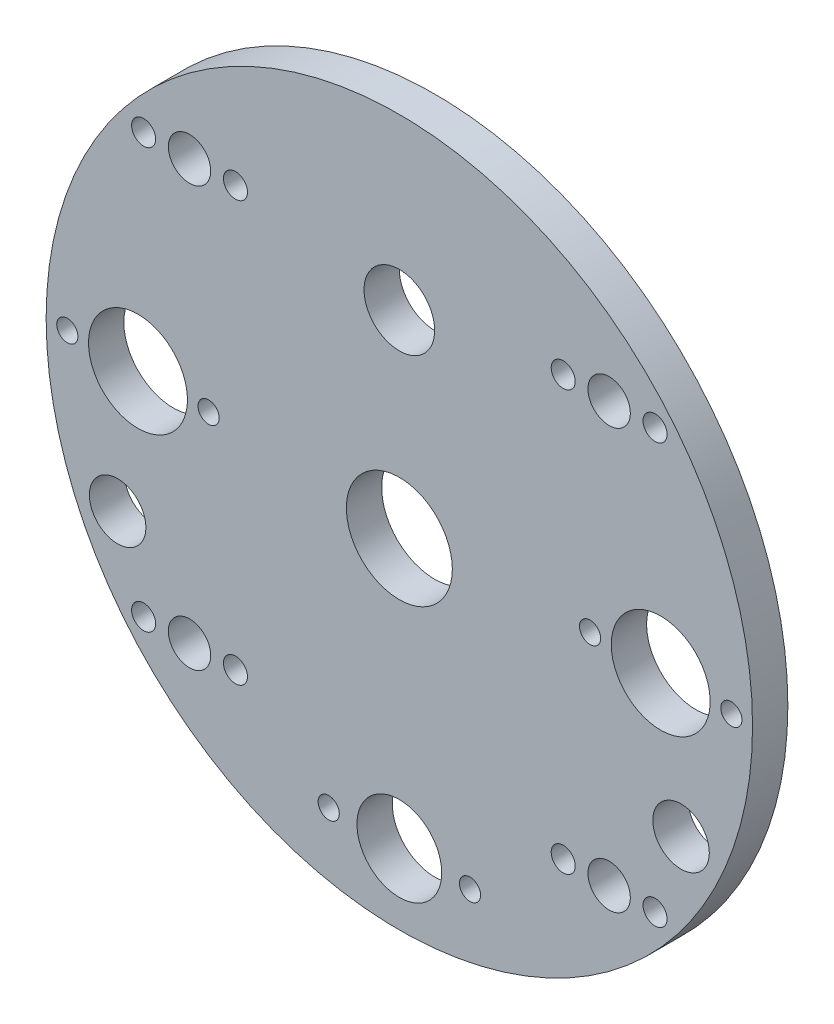
ISO-10303-21;
HEADER;
FILE_DESCRIPTION(('STEP AP214'),'2;1');
FILE_NAME('part.step','',(''),(''),'','','');
FILE_SCHEMA(('AUTOMOTIVE_DESIGN { 1 0 10303 214 1 1 1 1 }'));
ENDSEC;
DATA;
#1=APPLICATION_CONTEXT('core data for automotive mechanical design processes');
#2=APPLICATION_PROTOCOL_DEFINITION('international standard','automotive_design',2000,#1);
#3=PRODUCT_CONTEXT('',#1,'mechanical');
#4=PRODUCT('Part','Part','',(#3));
#5=PRODUCT_RELATED_PRODUCT_CATEGORY('part','',(#4));
#6=PRODUCT_DEFINITION_FORMATION('','',#4);
#7=PRODUCT_DEFINITION_CONTEXT('part definition',#1,'design');
#8=PRODUCT_DEFINITION('design','',#6,#7);
#9=PRODUCT_DEFINITION_SHAPE('','',#8);
#10=(LENGTH_UNIT() NAMED_UNIT(*) SI_UNIT(.MILLI.,.METRE.));
#11=(NAMED_UNIT(*) PLANE_ANGLE_UNIT() SI_UNIT($,.RADIAN.));
#12=(NAMED_UNIT(*) SI_UNIT($,.STERADIAN.) SOLID_ANGLE_UNIT());
#13=UNCERTAINTY_MEASURE_WITH_UNIT(LENGTH_MEASURE(1.E-05),#10,'distance_accuracy_value','');
#14=(GEOMETRIC_REPRESENTATION_CONTEXT(3) GLOBAL_UNCERTAINTY_ASSIGNED_CONTEXT((#13)) GLOBAL_UNIT_ASSIGNED_CONTEXT((#10,
#11,#12)) REPRESENTATION_CONTEXT('',''));
#15=CARTESIAN_POINT('',(0.,0.,0.));
#16=DIRECTION('',(0.,0.,1.));
#17=DIRECTION('',(1.,0.,0.));
#18=AXIS2_PLACEMENT_3D('',#15,#16,#17);
#19=CARTESIAN_POINT('',(0.,0.,5.));
#20=DIRECTION('',(0.,0.,-1.));
#21=DIRECTION('',(-1.,0.,0.));
#22=AXIS2_PLACEMENT_3D('',#19,#20,#21);
#23=CYLINDRICAL_SURFACE('',#22,50.);
#24=CARTESIAN_POINT('',(0.,0.,5.));
#25=DIRECTION('',(0.,0.,1.));
#26=DIRECTION('',(1.,0.,0.));
#27=AXIS2_PLACEMENT_3D('',#24,#25,#26);
#28=CIRCLE('',#27,50.);
#29=CARTESIAN_POINT('',(50.,0.,5.));
#30=VERTEX_POINT('',#29);
#31=EDGE_CURVE('E10',#30,#30,#28,.T.);
#32=ORIENTED_EDGE('',*,*,#31,.F.);
#33=EDGE_LOOP('',(#32));
#34=FACE_BOUND('',#33,.T.);
#35=CARTESIAN_POINT('',(0.,0.,0.));
#36=DIRECTION('',(0.,0.,1.));
#37=DIRECTION('',(1.,0.,0.));
#38=AXIS2_PLACEMENT_3D('',#35,#36,#37);
#39=CIRCLE('',#38,50.);
#40=CARTESIAN_POINT('',(50.,0.,0.));
#41=VERTEX_POINT('',#40);
#42=EDGE_CURVE('E40',#41,#41,#39,.T.);
#43=ORIENTED_EDGE('',*,*,#42,.T.);
#44=EDGE_LOOP('',(#43));
#45=FACE_BOUND('',#44,.T.);
#46=ADVANCED_FACE('F33',(#34,#45),#23,.T.);
#47=CARTESIAN_POINT('',(0.,0.,5.));
#48=DIRECTION('',(0.,0.,1.));
#49=DIRECTION('',(1.,0.,0.));
#50=AXIS2_PLACEMENT_3D('',#47,#48,#49);
#51=PLANE('',#50);
#52=CARTESIAN_POINT('',(36.1984848098347,-29.6984848098353,5.));
#53=DIRECTION('',(0.,0.,1.));
#54=DIRECTION('',(1.,0.,0.));
#55=AXIS2_PLACEMENT_3D('',#52,#53,#54);
#56=CIRCLE('',#55,1.7);
#57=CARTESIAN_POINT('',(37.8984848098347,-29.6984848098353,5.));
#58=VERTEX_POINT('',#57);
#59=EDGE_CURVE('E183',#58,#58,#56,.T.);
#60=ORIENTED_EDGE('',*,*,#59,.F.);
#61=EDGE_LOOP('',(#60));
#62=FACE_BOUND('',#61,.T.);
#63=CARTESIAN_POINT('',(23.1984848098347,-29.6984848098353,5.));
#64=DIRECTION('',(0.,0.,1.));
#65=DIRECTION('',(1.,0.,0.));
#66=AXIS2_PLACEMENT_3D('',#63,#64,#65);
#67=CIRCLE('',#66,1.7);
#68=CARTESIAN_POINT('',(24.8984848098347,-29.6984848098353,5.));
#69=VERTEX_POINT('',#68);
#70=EDGE_CURVE('E187',#69,#69,#67,.T.);
#71=ORIENTED_EDGE('',*,*,#70,.F.);
#72=EDGE_LOOP('',(#71));
#73=FACE_BOUND('',#72,.T.);
#74=CARTESIAN_POINT('',(36.1984848098347,29.6984848098353,5.));
#75=DIRECTION('',(0.,0.,1.));
#76=DIRECTION('',(1.,0.,0.));
#77=AXIS2_PLACEMENT_3D('',#74,#75,#76);
#78=CIRCLE('',#77,1.7);
#79=CARTESIAN_POINT('',(37.8984848098347,29.6984848098353,5.));
#80=VERTEX_POINT('',#79);
#81=EDGE_CURVE('E191',#80,#80,#78,.T.);
#82=ORIENTED_EDGE('',*,*,#81,.F.);
#83=EDGE_LOOP('',(#82));
#84=FACE_BOUND('',#83,.T.);
#85=CARTESIAN_POINT('',(23.1984848098347,29.6984848098353,5.));
#86=DIRECTION('',(0.,0.,1.));
#87=DIRECTION('',(1.,0.,0.));
#88=AXIS2_PLACEMENT_3D('',#85,#86,#87);
#89=CIRCLE('',#88,1.7);
#90=CARTESIAN_POINT('',(24.8984848098347,29.6984848098353,5.));
#91=VERTEX_POINT('',#90);
#92=EDGE_CURVE('E195',#91,#91,#89,.T.);
#93=ORIENTED_EDGE('',*,*,#92,.F.);
#94=EDGE_LOOP('',(#93));
#95=FACE_BOUND('',#94,.T.);
#96=CARTESIAN_POINT('',(-36.1984848098347,29.6984848098353,5.));
#97=DIRECTION('',(0.,0.,1.));
#98=DIRECTION('',(1.,0.,0.));
#99=AXIS2_PLACEMENT_3D('',#96,#97,#98);
#100=CIRCLE('',#99,1.7);
#101=CARTESIAN_POINT('',(-34.4984848098347,29.6984848098353,5.));
#102=VERTEX_POINT('',#101);
#103=EDGE_CURVE('E199',#102,#102,#100,.T.);
#104=ORIENTED_EDGE('',*,*,#103,.F.);
#105=EDGE_LOOP('',(#104));
#106=FACE_BOUND('',#105,.T.);
#107=CARTESIAN_POINT('',(-23.1984848098347,29.6984848098353,5.));
#108=DIRECTION('',(0.,0.,1.));
#109=DIRECTION('',(1.,0.,0.));
#110=AXIS2_PLACEMENT_3D('',#107,#108,#109);
#111=CIRCLE('',#110,1.7);
#112=CARTESIAN_POINT('',(-21.4984848098347,29.6984848098353,5.));
#113=VERTEX_POINT('',#112);
#114=EDGE_CURVE('E203',#113,#113,#111,.T.);
#115=ORIENTED_EDGE('',*,*,#114,.F.);
#116=EDGE_LOOP('',(#115));
#117=FACE_BOUND('',#116,.T.);
#118=CARTESIAN_POINT('',(-36.1984848098347,-29.6984848098353,5.));
#119=DIRECTION('',(0.,0.,1.));
#120=DIRECTION('',(1.,0.,0.));
#121=AXIS2_PLACEMENT_3D('',#118,#119,#120);
#122=CIRCLE('',#121,1.7);
#123=CARTESIAN_POINT('',(-34.4984848098347,-29.6984848098353,5.));
#124=VERTEX_POINT('',#123);
#125=EDGE_CURVE('E207',#124,#124,#122,.T.);
#126=ORIENTED_EDGE('',*,*,#125,.F.);
#127=EDGE_LOOP('',(#126));
#128=FACE_BOUND('',#127,.T.);
#129=CARTESIAN_POINT('',(-23.1984848098347,-29.6984848098353,5.));
#130=DIRECTION('',(0.,0.,1.));
#131=DIRECTION('',(1.,0.,0.));
#132=AXIS2_PLACEMENT_3D('',#129,#130,#131);
#133=CIRCLE('',#132,1.7);
#134=CARTESIAN_POINT('',(-21.4984848098347,-29.6984848098353,5.));
#135=VERTEX_POINT('',#134);
#136=EDGE_CURVE('E211',#135,#135,#133,.T.);
#137=ORIENTED_EDGE('',*,*,#136,.F.);
#138=EDGE_LOOP('',(#137));
#139=FACE_BOUND('',#138,.T.);
#140=CARTESIAN_POINT('',(39.8775426296126,-18.5952035165908,5.));
#141=DIRECTION('',(0.,0.,-1.));
#142=DIRECTION('',(-1.,0.,0.));
#143=AXIS2_PLACEMENT_3D('',#140,#141,#142);
#144=CIRCLE('',#143,4.00000000000001);
#145=CARTESIAN_POINT('',(35.8775426296126,-18.5952035165908,5.));
#146=VERTEX_POINT('',#145);
#147=EDGE_CURVE('E109',#146,#146,#144,.T.);
#148=ORIENTED_EDGE('',*,*,#147,.T.);
#149=EDGE_LOOP('',(#148));
#150=FACE_BOUND('',#149,.T.);
#151=CARTESIAN_POINT('',(-39.8775426296126,-18.5952035165908,5.));
#152=DIRECTION('',(0.,0.,1.));
#153=DIRECTION('',(1.,0.,0.));
#154=AXIS2_PLACEMENT_3D('',#151,#152,#153);
#155=CIRCLE('',#154,4.00000000000001);
#156=CARTESIAN_POINT('',(-35.8775426296126,-18.5952035165908,5.));
#157=VERTEX_POINT('',#156);
#158=EDGE_CURVE('E98',#157,#157,#155,.T.);
#159=ORIENTED_EDGE('',*,*,#158,.F.);
#160=EDGE_LOOP('',(#159));
#161=FACE_BOUND('',#160,.T.);
#162=CARTESIAN_POINT('',(-47.,0.,5.));
#163=DIRECTION('',(0.,0.,1.));
#164=DIRECTION('',(1.,0.,0.));
#165=AXIS2_PLACEMENT_3D('',#162,#163,#164);
#166=CIRCLE('',#165,1.5);
#167=CARTESIAN_POINT('',(-45.5,0.,5.));
#168=VERTEX_POINT('',#167);
#169=EDGE_CURVE('E78',#168,#168,#166,.T.);
#170=ORIENTED_EDGE('',*,*,#169,.F.);
#171=EDGE_LOOP('',(#170));
#172=FACE_BOUND('',#171,.T.);
#173=CARTESIAN_POINT('',(0.,-40.,5.));
#174=DIRECTION('',(0.,0.,1.));
#175=DIRECTION('',(1.,0.,0.));
#176=AXIS2_PLACEMENT_3D('',#173,#174,#175);
#177=CIRCLE('',#176,6.);
#178=CARTESIAN_POINT('',(6.,-40.,5.));
#179=VERTEX_POINT('',#178);
#180=EDGE_CURVE('E97',#179,#179,#177,.T.);
#181=ORIENTED_EDGE('',*,*,#180,.F.);
#182=EDGE_LOOP('',(#181));
#183=FACE_BOUND('',#182,.T.);
#184=CARTESIAN_POINT('',(-10.,-40.,5.));
#185=DIRECTION('',(0.,0.,1.));
#186=DIRECTION('',(1.,0.,0.));
#187=AXIS2_PLACEMENT_3D('',#184,#185,#186);
#188=CIRCLE('',#187,1.5);
#189=CARTESIAN_POINT('',(-8.5,-40.,5.));
#190=VERTEX_POINT('',#189);
#191=EDGE_CURVE('E102',#190,#190,#188,.T.);
#192=ORIENTED_EDGE('',*,*,#191,.F.);
#193=EDGE_LOOP('',(#192));
#194=FACE_BOUND('',#193,.T.);
#195=CARTESIAN_POINT('',(-27.,0.,5.));
#196=DIRECTION('',(0.,0.,1.));
#197=DIRECTION('',(1.,0.,0.));
#198=AXIS2_PLACEMENT_3D('',#195,#196,#197);
#199=CIRCLE('',#198,1.5);
#200=CARTESIAN_POINT('',(-25.5,0.,5.));
#201=VERTEX_POINT('',#200);
#202=EDGE_CURVE('E115',#201,#201,#199,.T.);
#203=ORIENTED_EDGE('',*,*,#202,.F.);
#204=EDGE_LOOP('',(#203));
#205=FACE_BOUND('',#204,.T.);
#206=CARTESIAN_POINT('',(27.,0.,5.));
#207=DIRECTION('',(0.,0.,1.));
#208=DIRECTION('',(1.,0.,0.));
#209=AXIS2_PLACEMENT_3D('',#206,#207,#208);
#210=CIRCLE('',#209,1.5);
#211=CARTESIAN_POINT('',(28.5,0.,5.));
#212=VERTEX_POINT('',#211);
#213=EDGE_CURVE('E122',#212,#212,#210,.T.);
#214=ORIENTED_EDGE('',*,*,#213,.F.);
#215=EDGE_LOOP('',(#214));
#216=FACE_BOUND('',#215,.T.);
#217=CARTESIAN_POINT('',(47.,0.,5.));
#218=DIRECTION('',(0.,0.,1.));
#219=DIRECTION('',(1.,0.,0.));
#220=AXIS2_PLACEMENT_3D('',#217,#218,#219);
#221=CIRCLE('',#220,1.5);
#222=CARTESIAN_POINT('',(48.5,0.,5.));
#223=VERTEX_POINT('',#222);
#224=EDGE_CURVE('E119',#223,#223,#221,.T.);
#225=ORIENTED_EDGE('',*,*,#224,.F.);
#226=EDGE_LOOP('',(#225));
#227=FACE_BOUND('',#226,.T.);
#228=CARTESIAN_POINT('',(10.,-40.,5.));
#229=DIRECTION('',(0.,0.,1.));
#230=DIRECTION('',(1.,0.,0.));
#231=AXIS2_PLACEMENT_3D('',#228,#229,#230);
#232=CIRCLE('',#231,1.5);
#233=CARTESIAN_POINT('',(11.5,-40.,5.));
#234=VERTEX_POINT('',#233);
#235=EDGE_CURVE('E117',#234,#234,#232,.T.);
#236=ORIENTED_EDGE('',*,*,#235,.F.);
#237=EDGE_LOOP('',(#236));
#238=FACE_BOUND('',#237,.T.);
#239=CARTESIAN_POINT('',(0.,-2.,5.));
#240=DIRECTION('',(0.,0.,1.));
#241=DIRECTION('',(1.,0.,0.));
#242=AXIS2_PLACEMENT_3D('',#239,#240,#241);
#243=CIRCLE('',#242,7.5);
#244=CARTESIAN_POINT('',(7.5,-2.,5.));
#245=VERTEX_POINT('',#244);
#246=EDGE_CURVE('E73',#245,#245,#243,.T.);
#247=ORIENTED_EDGE('',*,*,#246,.F.);
#248=EDGE_LOOP('',(#247));
#249=FACE_BOUND('',#248,.T.);
#250=CARTESIAN_POINT('',(-29.6984848098347,-29.6984848098353,5.));
#251=DIRECTION('',(0.,0.,1.));
#252=DIRECTION('',(0.,1.,0.));
#253=AXIS2_PLACEMENT_3D('',#250,#251,#252);
#254=CIRCLE('',#253,3.);
#255=CARTESIAN_POINT('',(-29.6984848098347,-26.6984848098353,5.));
#256=VERTEX_POINT('',#255);
#257=EDGE_CURVE('E63',#256,#256,#254,.T.);
#258=ORIENTED_EDGE('',*,*,#257,.F.);
#259=EDGE_LOOP('',(#258));
#260=FACE_BOUND('',#259,.T.);
#261=CARTESIAN_POINT('',(29.6984848098352,-29.6984848098348,5.));
#262=DIRECTION('',(0.,0.,1.));
#263=DIRECTION('',(-1.,0.,0.));
#264=AXIS2_PLACEMENT_3D('',#261,#262,#263);
#265=CIRCLE('',#264,3.);
#266=CARTESIAN_POINT('',(26.6984848098352,-29.6984848098348,5.));
#267=VERTEX_POINT('',#266);
#268=EDGE_CURVE('E133',#267,#267,#265,.T.);
#269=ORIENTED_EDGE('',*,*,#268,.F.);
#270=EDGE_LOOP('',(#269));
#271=FACE_BOUND('',#270,.T.);
#272=CARTESIAN_POINT('',(29.6984848098345,29.6984848098355,5.));
#273=DIRECTION('',(0.,0.,1.));
#274=DIRECTION('',(0.,-1.,0.));
#275=AXIS2_PLACEMENT_3D('',#272,#273,#274);
#276=CIRCLE('',#275,3.);
#277=CARTESIAN_POINT('',(29.6984848098346,26.6984848098355,5.));
#278=VERTEX_POINT('',#277);
#279=EDGE_CURVE('E72',#278,#278,#276,.T.);
#280=ORIENTED_EDGE('',*,*,#279,.F.);
#281=EDGE_LOOP('',(#280));
#282=FACE_BOUND('',#281,.T.);
#283=CARTESIAN_POINT('',(-29.6984848098352,29.6984848098348,5.));
#284=DIRECTION('',(0.,0.,1.));
#285=DIRECTION('',(1.,0.,0.));
#286=AXIS2_PLACEMENT_3D('',#283,#284,#285);
#287=CIRCLE('',#286,3.);
#288=CARTESIAN_POINT('',(-26.6984848098352,29.6984848098348,5.));
#289=VERTEX_POINT('',#288);
#290=EDGE_CURVE('E58',#289,#289,#287,.T.);
#291=ORIENTED_EDGE('',*,*,#290,.F.);
#292=EDGE_LOOP('',(#291));
#293=FACE_BOUND('',#292,.T.);
#294=CARTESIAN_POINT('',(0.,26.,5.));
#295=DIRECTION('',(0.,0.,1.));
#296=DIRECTION('',(1.,0.,0.));
#297=AXIS2_PLACEMENT_3D('',#294,#295,#296);
#298=CIRCLE('',#297,5.);
#299=CARTESIAN_POINT('',(5.,26.,5.));
#300=VERTEX_POINT('',#299);
#301=EDGE_CURVE('E54',#300,#300,#298,.T.);
#302=ORIENTED_EDGE('',*,*,#301,.F.);
#303=EDGE_LOOP('',(#302));
#304=FACE_BOUND('',#303,.T.);
#305=CARTESIAN_POINT('',(-37.,0.,5.));
#306=DIRECTION('',(0.,0.,-1.));
#307=DIRECTION('',(-1.,0.,0.));
#308=AXIS2_PLACEMENT_3D('',#305,#306,#307);
#309=CIRCLE('',#308,7.);
#310=CARTESIAN_POINT('',(-44.,0.,5.));
#311=VERTEX_POINT('',#310);
#312=EDGE_CURVE('E144',#311,#311,#309,.T.);
#313=ORIENTED_EDGE('',*,*,#312,.T.);
#314=EDGE_LOOP('',(#313));
#315=FACE_BOUND('',#314,.T.);
#316=CARTESIAN_POINT('',(37.,2.68166793467571E-13,5.));
#317=DIRECTION('',(0.,0.,-1.));
#318=DIRECTION('',(-1.,0.,0.));
#319=AXIS2_PLACEMENT_3D('',#316,#317,#318);
#320=CIRCLE('',#319,7.);
#321=CARTESIAN_POINT('',(30.,2.68166793467571E-13,5.));
#322=VERTEX_POINT('',#321);
#323=EDGE_CURVE('E45',#322,#322,#320,.T.);
#324=ORIENTED_EDGE('',*,*,#323,.T.);
#325=EDGE_LOOP('',(#324));
#326=FACE_BOUND('',#325,.T.);
#327=ORIENTED_EDGE('',*,*,#31,.T.);
#328=EDGE_LOOP('',(#327));
#329=FACE_BOUND('',#328,.T.);
#330=ADVANCED_FACE('F153',(#62,#73,#84,#95,#106,#117,#128,#139,#150,#161,#172,#183,#194,#205,
#216,#227,#238,#249,#260,#271,#282,#293,#304,#315,#326,#329),#51,.T.);
#331=CARTESIAN_POINT('',(0.,0.,0.));
#332=DIRECTION('',(0.,0.,1.));
#333=DIRECTION('',(1.,0.,0.));
#334=AXIS2_PLACEMENT_3D('',#331,#332,#333);
#335=PLANE('',#334);
#336=CARTESIAN_POINT('',(36.1984848098347,-29.6984848098353,0.));
#337=DIRECTION('',(0.,0.,1.));
#338=DIRECTION('',(1.,0.,0.));
#339=AXIS2_PLACEMENT_3D('',#336,#337,#338);
#340=CIRCLE('',#339,1.7);
#341=CARTESIAN_POINT('',(37.8984848098347,-29.6984848098353,0.));
#342=VERTEX_POINT('',#341);
#343=EDGE_CURVE('E347',#342,#342,#340,.T.);
#344=ORIENTED_EDGE('',*,*,#343,.T.);
#345=EDGE_LOOP('',(#344));
#346=FACE_BOUND('',#345,.T.);
#347=CARTESIAN_POINT('',(23.1984848098347,-29.6984848098353,0.));
#348=DIRECTION('',(0.,0.,1.));
#349=DIRECTION('',(1.,0.,0.));
#350=AXIS2_PLACEMENT_3D('',#347,#348,#349);
#351=CIRCLE('',#350,1.7);
#352=CARTESIAN_POINT('',(24.8984848098347,-29.6984848098353,0.));
#353=VERTEX_POINT('',#352);
#354=EDGE_CURVE('E352',#353,#353,#351,.T.);
#355=ORIENTED_EDGE('',*,*,#354,.T.);
#356=EDGE_LOOP('',(#355));
#357=FACE_BOUND('',#356,.T.);
#358=CARTESIAN_POINT('',(36.1984848098347,29.6984848098353,0.));
#359=DIRECTION('',(0.,0.,1.));
#360=DIRECTION('',(1.,0.,0.));
#361=AXIS2_PLACEMENT_3D('',#358,#359,#360);
#362=CIRCLE('',#361,1.7);
#363=CARTESIAN_POINT('',(37.8984848098347,29.6984848098353,0.));
#364=VERTEX_POINT('',#363);
#365=EDGE_CURVE('E356',#364,#364,#362,.T.);
#366=ORIENTED_EDGE('',*,*,#365,.T.);
#367=EDGE_LOOP('',(#366));
#368=FACE_BOUND('',#367,.T.);
#369=CARTESIAN_POINT('',(23.1984848098347,29.6984848098353,0.));
#370=DIRECTION('',(0.,0.,1.));
#371=DIRECTION('',(1.,0.,0.));
#372=AXIS2_PLACEMENT_3D('',#369,#370,#371);
#373=CIRCLE('',#372,1.7);
#374=CARTESIAN_POINT('',(24.8984848098347,29.6984848098353,0.));
#375=VERTEX_POINT('',#374);
#376=EDGE_CURVE('E360',#375,#375,#373,.T.);
#377=ORIENTED_EDGE('',*,*,#376,.T.);
#378=EDGE_LOOP('',(#377));
#379=FACE_BOUND('',#378,.T.);
#380=CARTESIAN_POINT('',(-36.1984848098347,29.6984848098353,0.));
#381=DIRECTION('',(0.,0.,1.));
#382=DIRECTION('',(1.,0.,0.));
#383=AXIS2_PLACEMENT_3D('',#380,#381,#382);
#384=CIRCLE('',#383,1.7);
#385=CARTESIAN_POINT('',(-34.4984848098347,29.6984848098353,0.));
#386=VERTEX_POINT('',#385);
#387=EDGE_CURVE('E364',#386,#386,#384,.T.);
#388=ORIENTED_EDGE('',*,*,#387,.T.);
#389=EDGE_LOOP('',(#388));
#390=FACE_BOUND('',#389,.T.);
#391=CARTESIAN_POINT('',(-23.1984848098347,29.6984848098353,0.));
#392=DIRECTION('',(0.,0.,1.));
#393=DIRECTION('',(1.,0.,0.));
#394=AXIS2_PLACEMENT_3D('',#391,#392,#393);
#395=CIRCLE('',#394,1.7);
#396=CARTESIAN_POINT('',(-21.4984848098347,29.6984848098353,0.));
#397=VERTEX_POINT('',#396);
#398=EDGE_CURVE('E368',#397,#397,#395,.T.);
#399=ORIENTED_EDGE('',*,*,#398,.T.);
#400=EDGE_LOOP('',(#399));
#401=FACE_BOUND('',#400,.T.);
#402=CARTESIAN_POINT('',(-36.1984848098347,-29.6984848098353,0.));
#403=DIRECTION('',(0.,0.,1.));
#404=DIRECTION('',(1.,0.,0.));
#405=AXIS2_PLACEMENT_3D('',#402,#403,#404);
#406=CIRCLE('',#405,1.7);
#407=CARTESIAN_POINT('',(-34.4984848098347,-29.6984848098353,0.));
#408=VERTEX_POINT('',#407);
#409=EDGE_CURVE('E372',#408,#408,#406,.T.);
#410=ORIENTED_EDGE('',*,*,#409,.T.);
#411=EDGE_LOOP('',(#410));
#412=FACE_BOUND('',#411,.T.);
#413=CARTESIAN_POINT('',(-23.1984848098347,-29.6984848098353,0.));
#414=DIRECTION('',(0.,0.,1.));
#415=DIRECTION('',(1.,0.,0.));
#416=AXIS2_PLACEMENT_3D('',#413,#414,#415);
#417=CIRCLE('',#416,1.7);
#418=CARTESIAN_POINT('',(-21.4984848098347,-29.6984848098353,0.));
#419=VERTEX_POINT('',#418);
#420=EDGE_CURVE('E375',#419,#419,#417,.T.);
#421=ORIENTED_EDGE('',*,*,#420,.T.);
#422=EDGE_LOOP('',(#421));
#423=FACE_BOUND('',#422,.T.);
#424=CARTESIAN_POINT('',(39.8775426296126,-18.5952035165908,0.));
#425=DIRECTION('',(0.,0.,1.));
#426=DIRECTION('',(1.,0.,0.));
#427=AXIS2_PLACEMENT_3D('',#424,#425,#426);
#428=CIRCLE('',#427,4.00000000000001);
#429=CARTESIAN_POINT('',(43.8775426296126,-18.5952035165908,0.));
#430=VERTEX_POINT('',#429);
#431=EDGE_CURVE('E36',#430,#430,#428,.F.);
#432=ORIENTED_EDGE('',*,*,#431,.F.);
#433=EDGE_LOOP('',(#432));
#434=FACE_BOUND('',#433,.T.);
#435=CARTESIAN_POINT('',(-39.8775426296126,-18.5952035165908,0.));
#436=DIRECTION('',(0.,0.,1.));
#437=DIRECTION('',(1.,0.,0.));
#438=AXIS2_PLACEMENT_3D('',#435,#436,#437);
#439=CIRCLE('',#438,4.00000000000001);
#440=CARTESIAN_POINT('',(-35.8775426296126,-18.5952035165908,0.));
#441=VERTEX_POINT('',#440);
#442=EDGE_CURVE('E95',#441,#441,#439,.T.);
#443=ORIENTED_EDGE('',*,*,#442,.T.);
#444=EDGE_LOOP('',(#443));
#445=FACE_BOUND('',#444,.T.);
#446=CARTESIAN_POINT('',(-47.,0.,0.));
#447=DIRECTION('',(0.,0.,1.));
#448=DIRECTION('',(1.,0.,0.));
#449=AXIS2_PLACEMENT_3D('',#446,#447,#448);
#450=CIRCLE('',#449,1.5);
#451=CARTESIAN_POINT('',(-45.5,0.,0.));
#452=VERTEX_POINT('',#451);
#453=EDGE_CURVE('E93',#452,#452,#450,.T.);
#454=ORIENTED_EDGE('',*,*,#453,.T.);
#455=EDGE_LOOP('',(#454));
#456=FACE_BOUND('',#455,.T.);
#457=CARTESIAN_POINT('',(0.,-40.,0.));
#458=DIRECTION('',(0.,0.,1.));
#459=DIRECTION('',(1.,0.,0.));
#460=AXIS2_PLACEMENT_3D('',#457,#458,#459);
#461=CIRCLE('',#460,6.);
#462=CARTESIAN_POINT('',(6.,-40.,0.));
#463=VERTEX_POINT('',#462);
#464=EDGE_CURVE('E90',#463,#463,#461,.T.);
#465=ORIENTED_EDGE('',*,*,#464,.T.);
#466=EDGE_LOOP('',(#465));
#467=FACE_BOUND('',#466,.T.);
#468=CARTESIAN_POINT('',(-10.,-40.,0.));
#469=DIRECTION('',(0.,0.,1.));
#470=DIRECTION('',(1.,0.,0.));
#471=AXIS2_PLACEMENT_3D('',#468,#469,#470);
#472=CIRCLE('',#471,1.5);
#473=CARTESIAN_POINT('',(-8.5,-40.,0.));
#474=VERTEX_POINT('',#473);
#475=EDGE_CURVE('E87',#474,#474,#472,.T.);
#476=ORIENTED_EDGE('',*,*,#475,.T.);
#477=EDGE_LOOP('',(#476));
#478=FACE_BOUND('',#477,.T.);
#479=CARTESIAN_POINT('',(-27.,0.,0.));
#480=DIRECTION('',(0.,0.,1.));
#481=DIRECTION('',(1.,0.,0.));
#482=AXIS2_PLACEMENT_3D('',#479,#480,#481);
#483=CIRCLE('',#482,1.5);
#484=CARTESIAN_POINT('',(-25.5,0.,0.));
#485=VERTEX_POINT('',#484);
#486=EDGE_CURVE('E84',#485,#485,#483,.T.);
#487=ORIENTED_EDGE('',*,*,#486,.T.);
#488=EDGE_LOOP('',(#487));
#489=FACE_BOUND('',#488,.T.);
#490=CARTESIAN_POINT('',(27.,0.,0.));
#491=DIRECTION('',(0.,0.,1.));
#492=DIRECTION('',(1.,0.,0.));
#493=AXIS2_PLACEMENT_3D('',#490,#491,#492);
#494=CIRCLE('',#493,1.5);
#495=CARTESIAN_POINT('',(28.5,0.,0.));
#496=VERTEX_POINT('',#495);
#497=EDGE_CURVE('E81',#496,#496,#494,.T.);
#498=ORIENTED_EDGE('',*,*,#497,.T.);
#499=EDGE_LOOP('',(#498));
#500=FACE_BOUND('',#499,.T.);
#501=CARTESIAN_POINT('',(47.,0.,0.));
#502=DIRECTION('',(0.,0.,1.));
#503=DIRECTION('',(1.,0.,0.));
#504=AXIS2_PLACEMENT_3D('',#501,#502,#503);
#505=CIRCLE('',#504,1.5);
#506=CARTESIAN_POINT('',(48.5,0.,0.));
#507=VERTEX_POINT('',#506);
#508=EDGE_CURVE('E77',#507,#507,#505,.T.);
#509=ORIENTED_EDGE('',*,*,#508,.T.);
#510=EDGE_LOOP('',(#509));
#511=FACE_BOUND('',#510,.T.);
#512=CARTESIAN_POINT('',(10.,-40.,0.));
#513=DIRECTION('',(0.,0.,1.));
#514=DIRECTION('',(1.,0.,0.));
#515=AXIS2_PLACEMENT_3D('',#512,#513,#514);
#516=CIRCLE('',#515,1.5);
#517=CARTESIAN_POINT('',(11.5,-40.,0.));
#518=VERTEX_POINT('',#517);
#519=EDGE_CURVE('E74',#518,#518,#516,.T.);
#520=ORIENTED_EDGE('',*,*,#519,.T.);
#521=EDGE_LOOP('',(#520));
#522=FACE_BOUND('',#521,.T.);
#523=CARTESIAN_POINT('',(0.,-2.,0.));
#524=DIRECTION('',(0.,0.,1.));
#525=DIRECTION('',(1.,0.,0.));
#526=AXIS2_PLACEMENT_3D('',#523,#524,#525);
#527=CIRCLE('',#526,7.5);
#528=CARTESIAN_POINT('',(7.5,-2.,0.));
#529=VERTEX_POINT('',#528);
#530=EDGE_CURVE('E69',#529,#529,#527,.T.);
#531=ORIENTED_EDGE('',*,*,#530,.T.);
#532=EDGE_LOOP('',(#531));
#533=FACE_BOUND('',#532,.T.);
#534=CARTESIAN_POINT('',(-29.6984848098347,-29.6984848098353,0.));
#535=DIRECTION('',(0.,0.,1.));
#536=DIRECTION('',(1.,0.,0.));
#537=AXIS2_PLACEMENT_3D('',#534,#535,#536);
#538=CIRCLE('',#537,3.);
#539=CARTESIAN_POINT('',(-26.6984848098347,-29.6984848098353,0.));
#540=VERTEX_POINT('',#539);
#541=EDGE_CURVE('E66',#540,#540,#538,.T.);
#542=ORIENTED_EDGE('',*,*,#541,.T.);
#543=EDGE_LOOP('',(#542));
#544=FACE_BOUND('',#543,.T.);
#545=CARTESIAN_POINT('',(29.6984848098352,-29.6984848098348,0.));
#546=DIRECTION('',(0.,0.,1.));
#547=DIRECTION('',(1.,0.,0.));
#548=AXIS2_PLACEMENT_3D('',#545,#546,#547);
#549=CIRCLE('',#548,3.);
#550=CARTESIAN_POINT('',(32.6984848098352,-29.6984848098348,0.));
#551=VERTEX_POINT('',#550);
#552=EDGE_CURVE('E62',#551,#551,#549,.T.);
#553=ORIENTED_EDGE('',*,*,#552,.T.);
#554=EDGE_LOOP('',(#553));
#555=FACE_BOUND('',#554,.T.);
#556=CARTESIAN_POINT('',(29.6984848098345,29.6984848098355,0.));
#557=DIRECTION('',(0.,0.,1.));
#558=DIRECTION('',(1.,0.,0.));
#559=AXIS2_PLACEMENT_3D('',#556,#557,#558);
#560=CIRCLE('',#559,3.);
#561=CARTESIAN_POINT('',(32.6984848098345,29.6984848098355,0.));
#562=VERTEX_POINT('',#561);
#563=EDGE_CURVE('E59',#562,#562,#560,.T.);
#564=ORIENTED_EDGE('',*,*,#563,.T.);
#565=EDGE_LOOP('',(#564));
#566=FACE_BOUND('',#565,.T.);
#567=CARTESIAN_POINT('',(-29.6984848098352,29.6984848098348,0.));
#568=DIRECTION('',(0.,0.,1.));
#569=DIRECTION('',(1.,0.,0.));
#570=AXIS2_PLACEMENT_3D('',#567,#568,#569);
#571=CIRCLE('',#570,3.);
#572=CARTESIAN_POINT('',(-26.6984848098352,29.6984848098348,0.));
#573=VERTEX_POINT('',#572);
#574=EDGE_CURVE('E55',#573,#573,#571,.T.);
#575=ORIENTED_EDGE('',*,*,#574,.T.);
#576=EDGE_LOOP('',(#575));
#577=FACE_BOUND('',#576,.T.);
#578=CARTESIAN_POINT('',(0.,26.,0.));
#579=DIRECTION('',(0.,0.,1.));
#580=DIRECTION('',(1.,0.,0.));
#581=AXIS2_PLACEMENT_3D('',#578,#579,#580);
#582=CIRCLE('',#581,5.);
#583=CARTESIAN_POINT('',(5.,26.,0.));
#584=VERTEX_POINT('',#583);
#585=EDGE_CURVE('E50',#584,#584,#582,.T.);
#586=ORIENTED_EDGE('',*,*,#585,.T.);
#587=EDGE_LOOP('',(#586));
#588=FACE_BOUND('',#587,.T.);
#589=CARTESIAN_POINT('',(-37.,0.,0.));
#590=DIRECTION('',(0.,0.,-1.));
#591=DIRECTION('',(-1.,0.,0.));
#592=AXIS2_PLACEMENT_3D('',#589,#590,#591);
#593=CIRCLE('',#592,7.);
#594=CARTESIAN_POINT('',(-44.,0.,0.));
#595=VERTEX_POINT('',#594);
#596=EDGE_CURVE('E53',#595,#595,#593,.T.);
#597=ORIENTED_EDGE('',*,*,#596,.F.);
#598=EDGE_LOOP('',(#597));
#599=FACE_BOUND('',#598,.T.);
#600=CARTESIAN_POINT('',(37.,2.68166793467571E-13,0.));
#601=DIRECTION('',(0.,0.,-1.));
#602=DIRECTION('',(-1.,0.,0.));
#603=AXIS2_PLACEMENT_3D('',#600,#601,#602);
#604=CIRCLE('',#603,7.);
#605=CARTESIAN_POINT('',(30.,2.68166793467571E-13,0.));
#606=VERTEX_POINT('',#605);
#607=EDGE_CURVE('E146',#606,#606,#604,.T.);
#608=ORIENTED_EDGE('',*,*,#607,.F.);
#609=EDGE_LOOP('',(#608));
#610=FACE_BOUND('',#609,.T.);
#611=ORIENTED_EDGE('',*,*,#42,.F.);
#612=EDGE_LOOP('',(#611));
#613=FACE_BOUND('',#612,.T.);
#614=ADVANCED_FACE('F158',(#346,#357,#368,#379,#390,#401,#412,#423,#434,#445,#456,#467,#478,
#489,#500,#511,#522,#533,#544,#555,#566,#577,#588,#599,#610,#613),#335,.F.);
#615=CARTESIAN_POINT('',(37.,2.68166793467571E-13,0.));
#616=DIRECTION('',(0.,0.,-1.));
#617=DIRECTION('',(-1.,0.,0.));
#618=AXIS2_PLACEMENT_3D('',#615,#616,#617);
#619=CYLINDRICAL_SURFACE('',#618,7.);
#620=ORIENTED_EDGE('',*,*,#323,.F.);
#621=EDGE_LOOP('',(#620));
#622=FACE_BOUND('',#621,.T.);
#623=ORIENTED_EDGE('',*,*,#607,.T.);
#624=EDGE_LOOP('',(#623));
#625=FACE_BOUND('',#624,.T.);
#626=ADVANCED_FACE('F155',(#622,#625),#619,.F.);
#627=CARTESIAN_POINT('',(-37.,0.,0.));
#628=DIRECTION('',(0.,0.,-1.));
#629=DIRECTION('',(-1.,0.,0.));
#630=AXIS2_PLACEMENT_3D('',#627,#628,#629);
#631=CYLINDRICAL_SURFACE('',#630,7.);
#632=ORIENTED_EDGE('',*,*,#312,.F.);
#633=EDGE_LOOP('',(#632));
#634=FACE_BOUND('',#633,.T.);
#635=ORIENTED_EDGE('',*,*,#596,.T.);
#636=EDGE_LOOP('',(#635));
#637=FACE_BOUND('',#636,.T.);
#638=ADVANCED_FACE('F157',(#634,#637),#631,.F.);
#639=CARTESIAN_POINT('',(0.,26.,-5.));
#640=DIRECTION('',(0.,0.,1.));
#641=DIRECTION('',(1.,0.,0.));
#642=AXIS2_PLACEMENT_3D('',#639,#640,#641);
#643=CYLINDRICAL_SURFACE('',#642,5.);
#644=ORIENTED_EDGE('',*,*,#301,.T.);
#645=EDGE_LOOP('',(#644));
#646=FACE_BOUND('',#645,.T.);
#647=ORIENTED_EDGE('',*,*,#585,.F.);
#648=EDGE_LOOP('',(#647));
#649=FACE_BOUND('',#648,.T.);
#650=ADVANCED_FACE('F164',(#646,#649),#643,.F.);
#651=CARTESIAN_POINT('',(-29.6984848098352,29.6984848098348,-5.));
#652=DIRECTION('',(0.,0.,1.));
#653=DIRECTION('',(1.,0.,0.));
#654=AXIS2_PLACEMENT_3D('',#651,#652,#653);
#655=CYLINDRICAL_SURFACE('',#654,3.);
#656=ORIENTED_EDGE('',*,*,#290,.T.);
#657=EDGE_LOOP('',(#656));
#658=FACE_BOUND('',#657,.T.);
#659=ORIENTED_EDGE('',*,*,#574,.F.);
#660=EDGE_LOOP('',(#659));
#661=FACE_BOUND('',#660,.T.);
#662=ADVANCED_FACE('F250',(#658,#661),#655,.F.);
#663=CARTESIAN_POINT('',(29.6984848098345,29.6984848098355,-5.));
#664=DIRECTION('',(0.,0.,1.));
#665=DIRECTION('',(1.,0.,0.));
#666=AXIS2_PLACEMENT_3D('',#663,#664,#665);
#667=CYLINDRICAL_SURFACE('',#666,3.);
#668=ORIENTED_EDGE('',*,*,#279,.T.);
#669=EDGE_LOOP('',(#668));
#670=FACE_BOUND('',#669,.T.);
#671=ORIENTED_EDGE('',*,*,#563,.F.);
#672=EDGE_LOOP('',(#671));
#673=FACE_BOUND('',#672,.T.);
#674=ADVANCED_FACE('F257',(#670,#673),#667,.F.);
#675=CARTESIAN_POINT('',(29.6984848098352,-29.6984848098348,-5.));
#676=DIRECTION('',(0.,0.,1.));
#677=DIRECTION('',(1.,0.,0.));
#678=AXIS2_PLACEMENT_3D('',#675,#676,#677);
#679=CYLINDRICAL_SURFACE('',#678,3.);
#680=ORIENTED_EDGE('',*,*,#268,.T.);
#681=EDGE_LOOP('',(#680));
#682=FACE_BOUND('',#681,.T.);
#683=ORIENTED_EDGE('',*,*,#552,.F.);
#684=EDGE_LOOP('',(#683));
#685=FACE_BOUND('',#684,.T.);
#686=ADVANCED_FACE('F263',(#682,#685),#679,.F.);
#687=CARTESIAN_POINT('',(-29.6984848098347,-29.6984848098353,-5.));
#688=DIRECTION('',(0.,0.,1.));
#689=DIRECTION('',(1.,0.,0.));
#690=AXIS2_PLACEMENT_3D('',#687,#688,#689);
#691=CYLINDRICAL_SURFACE('',#690,3.);
#692=ORIENTED_EDGE('',*,*,#257,.T.);
#693=EDGE_LOOP('',(#692));
#694=FACE_BOUND('',#693,.T.);
#695=ORIENTED_EDGE('',*,*,#541,.F.);
#696=EDGE_LOOP('',(#695));
#697=FACE_BOUND('',#696,.T.);
#698=ADVANCED_FACE('F267',(#694,#697),#691,.F.);
#699=CARTESIAN_POINT('',(0.,-2.,-5.));
#700=DIRECTION('',(0.,0.,1.));
#701=DIRECTION('',(1.,0.,0.));
#702=AXIS2_PLACEMENT_3D('',#699,#700,#701);
#703=CYLINDRICAL_SURFACE('',#702,7.5);
#704=ORIENTED_EDGE('',*,*,#246,.T.);
#705=EDGE_LOOP('',(#704));
#706=FACE_BOUND('',#705,.T.);
#707=ORIENTED_EDGE('',*,*,#530,.F.);
#708=EDGE_LOOP('',(#707));
#709=FACE_BOUND('',#708,.T.);
#710=ADVANCED_FACE('F271',(#706,#709),#703,.F.);
#711=CARTESIAN_POINT('',(10.,-40.,-5.));
#712=DIRECTION('',(0.,0.,1.));
#713=DIRECTION('',(1.,0.,0.));
#714=AXIS2_PLACEMENT_3D('',#711,#712,#713);
#715=CYLINDRICAL_SURFACE('',#714,1.5);
#716=ORIENTED_EDGE('',*,*,#235,.T.);
#717=EDGE_LOOP('',(#716));
#718=FACE_BOUND('',#717,.T.);
#719=ORIENTED_EDGE('',*,*,#519,.F.);
#720=EDGE_LOOP('',(#719));
#721=FACE_BOUND('',#720,.T.);
#722=ADVANCED_FACE('F275',(#718,#721),#715,.F.);
#723=CARTESIAN_POINT('',(47.,0.,-5.));
#724=DIRECTION('',(0.,0.,1.));
#725=DIRECTION('',(1.,0.,0.));
#726=AXIS2_PLACEMENT_3D('',#723,#724,#725);
#727=CYLINDRICAL_SURFACE('',#726,1.5);
#728=ORIENTED_EDGE('',*,*,#224,.T.);
#729=EDGE_LOOP('',(#728));
#730=FACE_BOUND('',#729,.T.);
#731=ORIENTED_EDGE('',*,*,#508,.F.);
#732=EDGE_LOOP('',(#731));
#733=FACE_BOUND('',#732,.T.);
#734=ADVANCED_FACE('F281',(#730,#733),#727,.F.);
#735=CARTESIAN_POINT('',(27.,0.,-5.));
#736=DIRECTION('',(0.,0.,1.));
#737=DIRECTION('',(1.,0.,0.));
#738=AXIS2_PLACEMENT_3D('',#735,#736,#737);
#739=CYLINDRICAL_SURFACE('',#738,1.5);
#740=ORIENTED_EDGE('',*,*,#213,.T.);
#741=EDGE_LOOP('',(#740));
#742=FACE_BOUND('',#741,.T.);
#743=ORIENTED_EDGE('',*,*,#497,.F.);
#744=EDGE_LOOP('',(#743));
#745=FACE_BOUND('',#744,.T.);
#746=ADVANCED_FACE('F277',(#742,#745),#739,.F.);
#747=CARTESIAN_POINT('',(-27.,0.,-5.));
#748=DIRECTION('',(0.,0.,1.));
#749=DIRECTION('',(1.,0.,0.));
#750=AXIS2_PLACEMENT_3D('',#747,#748,#749);
#751=CYLINDRICAL_SURFACE('',#750,1.5);
#752=ORIENTED_EDGE('',*,*,#202,.T.);
#753=EDGE_LOOP('',(#752));
#754=FACE_BOUND('',#753,.T.);
#755=ORIENTED_EDGE('',*,*,#486,.F.);
#756=EDGE_LOOP('',(#755));
#757=FACE_BOUND('',#756,.T.);
#758=ADVANCED_FACE('F280',(#754,#757),#751,.F.);
#759=CARTESIAN_POINT('',(-10.,-40.,-5.));
#760=DIRECTION('',(0.,0.,1.));
#761=DIRECTION('',(1.,0.,0.));
#762=AXIS2_PLACEMENT_3D('',#759,#760,#761);
#763=CYLINDRICAL_SURFACE('',#762,1.5);
#764=ORIENTED_EDGE('',*,*,#191,.T.);
#765=EDGE_LOOP('',(#764));
#766=FACE_BOUND('',#765,.T.);
#767=ORIENTED_EDGE('',*,*,#475,.F.);
#768=EDGE_LOOP('',(#767));
#769=FACE_BOUND('',#768,.T.);
#770=ADVANCED_FACE('F285',(#766,#769),#763,.F.);
#771=CARTESIAN_POINT('',(0.,-40.,-5.));
#772=DIRECTION('',(0.,0.,1.));
#773=DIRECTION('',(1.,0.,0.));
#774=AXIS2_PLACEMENT_3D('',#771,#772,#773);
#775=CYLINDRICAL_SURFACE('',#774,6.);
#776=ORIENTED_EDGE('',*,*,#180,.T.);
#777=EDGE_LOOP('',(#776));
#778=FACE_BOUND('',#777,.T.);
#779=ORIENTED_EDGE('',*,*,#464,.F.);
#780=EDGE_LOOP('',(#779));
#781=FACE_BOUND('',#780,.T.);
#782=ADVANCED_FACE('F293',(#778,#781),#775,.F.);
#783=CARTESIAN_POINT('',(-47.,0.,-5.));
#784=DIRECTION('',(0.,0.,1.));
#785=DIRECTION('',(1.,0.,0.));
#786=AXIS2_PLACEMENT_3D('',#783,#784,#785);
#787=CYLINDRICAL_SURFACE('',#786,1.5);
#788=ORIENTED_EDGE('',*,*,#169,.T.);
#789=EDGE_LOOP('',(#788));
#790=FACE_BOUND('',#789,.T.);
#791=ORIENTED_EDGE('',*,*,#453,.F.);
#792=EDGE_LOOP('',(#791));
#793=FACE_BOUND('',#792,.T.);
#794=ADVANCED_FACE('F296',(#790,#793),#787,.F.);
#795=CARTESIAN_POINT('',(-39.8775426296126,-18.5952035165908,-5.));
#796=DIRECTION('',(0.,0.,1.));
#797=DIRECTION('',(1.,0.,0.));
#798=AXIS2_PLACEMENT_3D('',#795,#796,#797);
#799=CYLINDRICAL_SURFACE('',#798,4.00000000000001);
#800=ORIENTED_EDGE('',*,*,#158,.T.);
#801=EDGE_LOOP('',(#800));
#802=FACE_BOUND('',#801,.T.);
#803=ORIENTED_EDGE('',*,*,#442,.F.);
#804=EDGE_LOOP('',(#803));
#805=FACE_BOUND('',#804,.T.);
#806=ADVANCED_FACE('F303',(#802,#805),#799,.F.);
#807=CARTESIAN_POINT('',(39.8775426296126,-18.5952035165908,-5.));
#808=DIRECTION('',(0.,0.,1.));
#809=DIRECTION('',(1.,0.,0.));
#810=AXIS2_PLACEMENT_3D('',#807,#808,#809);
#811=CYLINDRICAL_SURFACE('',#810,4.00000000000001);
#812=ORIENTED_EDGE('',*,*,#147,.F.);
#813=EDGE_LOOP('',(#812));
#814=FACE_BOUND('',#813,.T.);
#815=ORIENTED_EDGE('',*,*,#431,.T.);
#816=EDGE_LOOP('',(#815));
#817=FACE_BOUND('',#816,.T.);
#818=ADVANCED_FACE('F307',(#814,#817),#811,.F.);
#819=CARTESIAN_POINT('',(-23.1984848098347,-29.6984848098353,5.));
#820=DIRECTION('',(0.,0.,1.));
#821=DIRECTION('',(1.,0.,0.));
#822=AXIS2_PLACEMENT_3D('',#819,#820,#821);
#823=CYLINDRICAL_SURFACE('',#822,1.7);
#824=ORIENTED_EDGE('',*,*,#420,.F.);
#825=EDGE_LOOP('',(#824));
#826=FACE_BOUND('',#825,.T.);
#827=ORIENTED_EDGE('',*,*,#136,.T.);
#828=EDGE_LOOP('',(#827));
#829=FACE_BOUND('',#828,.T.);
#830=ADVANCED_FACE('F310',(#826,#829),#823,.F.);
#831=CARTESIAN_POINT('',(-36.1984848098347,-29.6984848098353,5.));
#832=DIRECTION('',(0.,0.,1.));
#833=DIRECTION('',(1.,0.,0.));
#834=AXIS2_PLACEMENT_3D('',#831,#832,#833);
#835=CYLINDRICAL_SURFACE('',#834,1.7);
#836=ORIENTED_EDGE('',*,*,#409,.F.);
#837=EDGE_LOOP('',(#836));
#838=FACE_BOUND('',#837,.T.);
#839=ORIENTED_EDGE('',*,*,#125,.T.);
#840=EDGE_LOOP('',(#839));
#841=FACE_BOUND('',#840,.T.);
#842=ADVANCED_FACE('F314',(#838,#841),#835,.F.);
#843=CARTESIAN_POINT('',(-23.1984848098347,29.6984848098353,5.));
#844=DIRECTION('',(0.,0.,1.));
#845=DIRECTION('',(1.,0.,0.));
#846=AXIS2_PLACEMENT_3D('',#843,#844,#845);
#847=CYLINDRICAL_SURFACE('',#846,1.7);
#848=ORIENTED_EDGE('',*,*,#398,.F.);
#849=EDGE_LOOP('',(#848));
#850=FACE_BOUND('',#849,.T.);
#851=ORIENTED_EDGE('',*,*,#114,.T.);
#852=EDGE_LOOP('',(#851));
#853=FACE_BOUND('',#852,.T.);
#854=ADVANCED_FACE('F318',(#850,#853),#847,.F.);
#855=CARTESIAN_POINT('',(-36.1984848098347,29.6984848098353,5.));
#856=DIRECTION('',(0.,0.,1.));
#857=DIRECTION('',(1.,0.,0.));
#858=AXIS2_PLACEMENT_3D('',#855,#856,#857);
#859=CYLINDRICAL_SURFACE('',#858,1.7);
#860=ORIENTED_EDGE('',*,*,#387,.F.);
#861=EDGE_LOOP('',(#860));
#862=FACE_BOUND('',#861,.T.);
#863=ORIENTED_EDGE('',*,*,#103,.T.);
#864=EDGE_LOOP('',(#863));
#865=FACE_BOUND('',#864,.T.);
#866=ADVANCED_FACE('F322',(#862,#865),#859,.F.);
#867=CARTESIAN_POINT('',(23.1984848098347,29.6984848098353,5.));
#868=DIRECTION('',(0.,0.,1.));
#869=DIRECTION('',(1.,0.,0.));
#870=AXIS2_PLACEMENT_3D('',#867,#868,#869);
#871=CYLINDRICAL_SURFACE('',#870,1.7);
#872=ORIENTED_EDGE('',*,*,#376,.F.);
#873=EDGE_LOOP('',(#872));
#874=FACE_BOUND('',#873,.T.);
#875=ORIENTED_EDGE('',*,*,#92,.T.);
#876=EDGE_LOOP('',(#875));
#877=FACE_BOUND('',#876,.T.);
#878=ADVANCED_FACE('F326',(#874,#877),#871,.F.);
#879=CARTESIAN_POINT('',(36.1984848098347,29.6984848098353,5.));
#880=DIRECTION('',(0.,0.,1.));
#881=DIRECTION('',(1.,0.,0.));
#882=AXIS2_PLACEMENT_3D('',#879,#880,#881);
#883=CYLINDRICAL_SURFACE('',#882,1.7);
#884=ORIENTED_EDGE('',*,*,#365,.F.);
#885=EDGE_LOOP('',(#884));
#886=FACE_BOUND('',#885,.T.);
#887=ORIENTED_EDGE('',*,*,#81,.T.);
#888=EDGE_LOOP('',(#887));
#889=FACE_BOUND('',#888,.T.);
#890=ADVANCED_FACE('F330',(#886,#889),#883,.F.);
#891=CARTESIAN_POINT('',(23.1984848098347,-29.6984848098353,5.));
#892=DIRECTION('',(0.,0.,1.));
#893=DIRECTION('',(1.,0.,0.));
#894=AXIS2_PLACEMENT_3D('',#891,#892,#893);
#895=CYLINDRICAL_SURFACE('',#894,1.7);
#896=ORIENTED_EDGE('',*,*,#354,.F.);
#897=EDGE_LOOP('',(#896));
#898=FACE_BOUND('',#897,.T.);
#899=ORIENTED_EDGE('',*,*,#70,.T.);
#900=EDGE_LOOP('',(#899));
#901=FACE_BOUND('',#900,.T.);
#902=ADVANCED_FACE('F334',(#898,#901),#895,.F.);
#903=CARTESIAN_POINT('',(36.1984848098347,-29.6984848098353,5.));
#904=DIRECTION('',(0.,0.,1.));
#905=DIRECTION('',(1.,0.,0.));
#906=AXIS2_PLACEMENT_3D('',#903,#904,#905);
#907=CYLINDRICAL_SURFACE('',#906,1.7);
#908=ORIENTED_EDGE('',*,*,#343,.F.);
#909=EDGE_LOOP('',(#908));
#910=FACE_BOUND('',#909,.T.);
#911=ORIENTED_EDGE('',*,*,#59,.T.);
#912=EDGE_LOOP('',(#911));
#913=FACE_BOUND('',#912,.T.);
#914=ADVANCED_FACE('F338',(#910,#913),#907,.F.);
#915=CLOSED_SHELL('',(#46,#330,#614,#626,#638,#650,#662,#674,#686,#698,#710,#722,#734,#746,#758,
#770,#782,#794,#806,#818,#830,#842,#854,#866,#878,#890,#902,#914));
#916=MANIFOLD_SOLID_BREP('B2',#915);
#917=ADVANCED_BREP_SHAPE_REPRESENTATION('',(#18,#916),#14);
#918=SHAPE_DEFINITION_REPRESENTATION(#9,#917);
ENDSEC;
END-ISO-10303-21;
